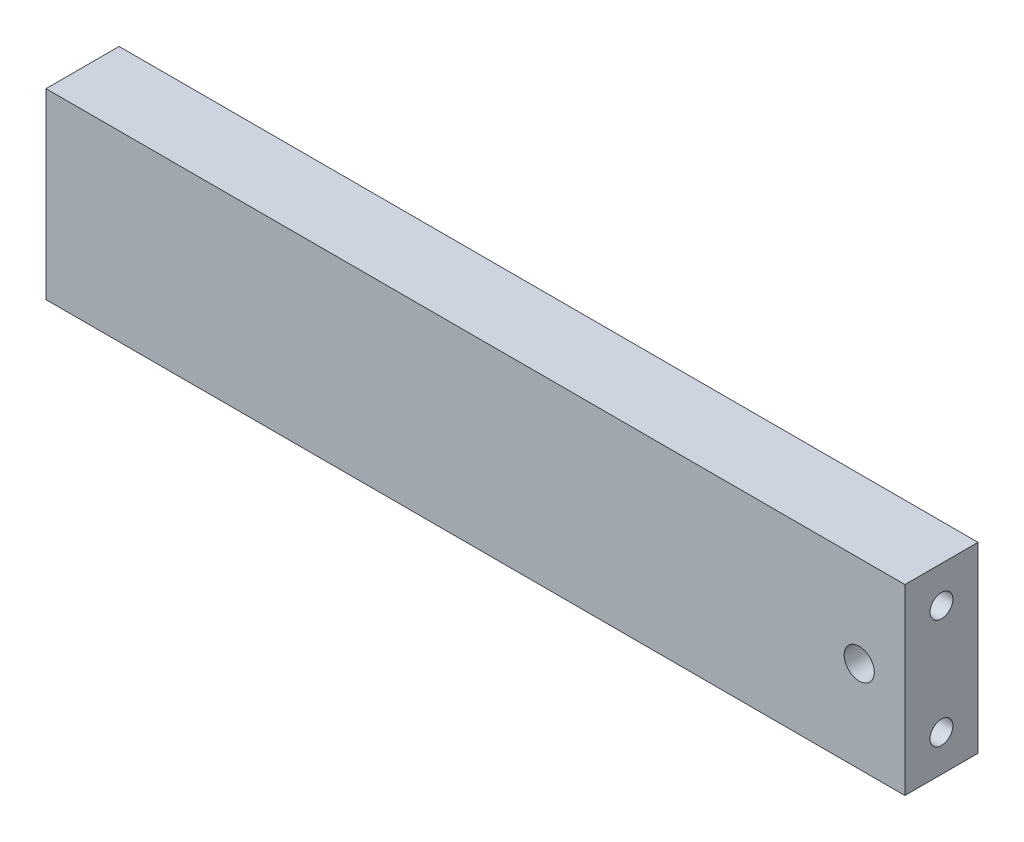
ISO-10303-21;
HEADER;
FILE_DESCRIPTION(('STEP AP214'),'2;1');
FILE_NAME('part.step','',(''),(''),'','','');
FILE_SCHEMA(('AUTOMOTIVE_DESIGN { 1 0 10303 214 1 1 1 1 }'));
ENDSEC;
DATA;
#1=APPLICATION_CONTEXT('core data for automotive mechanical design processes');
#2=APPLICATION_PROTOCOL_DEFINITION('international standard','automotive_design',2000,#1);
#3=PRODUCT_CONTEXT('',#1,'mechanical');
#4=PRODUCT('Part','Part','',(#3));
#5=PRODUCT_RELATED_PRODUCT_CATEGORY('part','',(#4));
#6=PRODUCT_DEFINITION_FORMATION('','',#4);
#7=PRODUCT_DEFINITION_CONTEXT('part definition',#1,'design');
#8=PRODUCT_DEFINITION('design','',#6,#7);
#9=PRODUCT_DEFINITION_SHAPE('','',#8);
#10=(LENGTH_UNIT() NAMED_UNIT(*) SI_UNIT(.MILLI.,.METRE.));
#11=(NAMED_UNIT(*) PLANE_ANGLE_UNIT() SI_UNIT($,.RADIAN.));
#12=(NAMED_UNIT(*) SI_UNIT($,.STERADIAN.) SOLID_ANGLE_UNIT());
#13=UNCERTAINTY_MEASURE_WITH_UNIT(LENGTH_MEASURE(1.E-05),#10,'distance_accuracy_value','');
#14=(GEOMETRIC_REPRESENTATION_CONTEXT(3) GLOBAL_UNCERTAINTY_ASSIGNED_CONTEXT((#13)) GLOBAL_UNIT_ASSIGNED_CONTEXT((#10,
#11,#12)) REPRESENTATION_CONTEXT('',''));
#15=CARTESIAN_POINT('',(0.,0.,0.));
#16=DIRECTION('',(0.,0.,1.));
#17=DIRECTION('',(1.,0.,0.));
#18=AXIS2_PLACEMENT_3D('',#15,#16,#17);
#19=CARTESIAN_POINT('',(47.,10.,8.));
#20=DIRECTION('',(-1.,0.,0.));
#21=DIRECTION('',(0.,0.,1.));
#22=AXIS2_PLACEMENT_3D('',#19,#20,#21);
#23=PLANE('',#22);
#24=CARTESIAN_POINT('',(47.,6.,4.));
#25=DIRECTION('',(1.,0.,0.));
#26=DIRECTION('',(0.,0.,-1.));
#27=AXIS2_PLACEMENT_3D('',#24,#25,#26);
#28=CIRCLE('',#27,1.24999999999999);
#29=CARTESIAN_POINT('',(47.,6.,2.75000000000001));
#30=VERTEX_POINT('',#29);
#31=EDGE_CURVE('E119',#30,#30,#28,.T.);
#32=ORIENTED_EDGE('',*,*,#31,.F.);
#33=EDGE_LOOP('',(#32));
#34=FACE_BOUND('',#33,.T.);
#35=CARTESIAN_POINT('',(47.,-6.,4.));
#36=DIRECTION('',(1.,0.,0.));
#37=DIRECTION('',(0.,0.,-1.));
#38=AXIS2_PLACEMENT_3D('',#35,#36,#37);
#39=CIRCLE('',#38,1.24999999999999);
#40=CARTESIAN_POINT('',(47.,-6.,2.75000000000001));
#41=VERTEX_POINT('',#40);
#42=EDGE_CURVE('E125',#41,#41,#39,.T.);
#43=ORIENTED_EDGE('',*,*,#42,.F.);
#44=EDGE_LOOP('',(#43));
#45=FACE_BOUND('',#44,.T.);
#46=DIRECTION('',(0.,1.,0.));
#47=VECTOR('',#46,1.);
#48=CARTESIAN_POINT('',(47.,10.,0.));
#49=LINE('',#48,#47);
#50=CARTESIAN_POINT('',(47.,-10.,0.));
#51=VERTEX_POINT('',#50);
#52=CARTESIAN_POINT('',(47.,10.,0.));
#53=VERTEX_POINT('',#52);
#54=EDGE_CURVE('E137',#51,#53,#49,.T.);
#55=ORIENTED_EDGE('',*,*,#54,.T.);
#56=DIRECTION('',(0.,0.,-1.));
#57=VECTOR('',#56,1.);
#58=CARTESIAN_POINT('',(47.,10.,8.));
#59=LINE('',#58,#57);
#60=CARTESIAN_POINT('',(47.,10.,8.));
#61=VERTEX_POINT('',#60);
#62=EDGE_CURVE('E11',#61,#53,#59,.T.);
#63=ORIENTED_EDGE('',*,*,#62,.F.);
#64=DIRECTION('',(0.,1.,0.));
#65=VECTOR('',#64,1.);
#66=CARTESIAN_POINT('',(47.,10.,8.));
#67=LINE('',#66,#65);
#68=CARTESIAN_POINT('',(47.,-10.,8.));
#69=VERTEX_POINT('',#68);
#70=EDGE_CURVE('E138',#69,#61,#67,.T.);
#71=ORIENTED_EDGE('',*,*,#70,.F.);
#72=DIRECTION('',(0.,0.,-1.));
#73=VECTOR('',#72,1.);
#74=CARTESIAN_POINT('',(47.,-10.,8.));
#75=LINE('',#74,#73);
#76=EDGE_CURVE('E144',#69,#51,#75,.T.);
#77=ORIENTED_EDGE('',*,*,#76,.T.);
#78=EDGE_LOOP('',(#55,#63,#71,#77));
#79=FACE_BOUND('',#78,.T.);
#80=ADVANCED_FACE('F38',(#34,#45,#79),#23,.F.);
#81=CARTESIAN_POINT('',(-47.,10.,8.));
#82=DIRECTION('',(0.,-1.,0.));
#83=DIRECTION('',(0.,0.,-1.));
#84=AXIS2_PLACEMENT_3D('',#81,#82,#83);
#85=PLANE('',#84);
#86=DIRECTION('',(-1.,0.,0.));
#87=VECTOR('',#86,1.);
#88=CARTESIAN_POINT('',(-47.,10.,0.));
#89=LINE('',#88,#87);
#90=CARTESIAN_POINT('',(-47.,10.,0.));
#91=VERTEX_POINT('',#90);
#92=EDGE_CURVE('E147',#53,#91,#89,.T.);
#93=ORIENTED_EDGE('',*,*,#92,.T.);
#94=DIRECTION('',(0.,0.,-1.));
#95=VECTOR('',#94,1.);
#96=CARTESIAN_POINT('',(-47.,10.,8.));
#97=LINE('',#96,#95);
#98=CARTESIAN_POINT('',(-47.,10.,8.));
#99=VERTEX_POINT('',#98);
#100=EDGE_CURVE('E46',#99,#91,#97,.T.);
#101=ORIENTED_EDGE('',*,*,#100,.F.);
#102=DIRECTION('',(-1.,0.,0.));
#103=VECTOR('',#102,1.);
#104=CARTESIAN_POINT('',(-47.,10.,8.));
#105=LINE('',#104,#103);
#106=EDGE_CURVE('E85',#61,#99,#105,.T.);
#107=ORIENTED_EDGE('',*,*,#106,.F.);
#108=ORIENTED_EDGE('',*,*,#62,.T.);
#109=EDGE_LOOP('',(#93,#101,#107,#108));
#110=FACE_BOUND('',#109,.T.);
#111=ADVANCED_FACE('F171',(#110),#85,.F.);
#112=CARTESIAN_POINT('',(-47.,10.,8.));
#113=DIRECTION('',(1.,0.,0.));
#114=DIRECTION('',(0.,1.,0.));
#115=AXIS2_PLACEMENT_3D('',#112,#113,#114);
#116=PLANE('',#115);
#117=CARTESIAN_POINT('',(-47.,5.99999999999999,4.));
#118=DIRECTION('',(-1.,0.,0.));
#119=DIRECTION('',(0.,0.,1.));
#120=AXIS2_PLACEMENT_3D('',#117,#118,#119);
#121=CIRCLE('',#120,1.24999999999999);
#122=CARTESIAN_POINT('',(-47.,5.99999999999999,5.24999999999999));
#123=VERTEX_POINT('',#122);
#124=EDGE_CURVE('E109',#123,#123,#121,.T.);
#125=ORIENTED_EDGE('',*,*,#124,.F.);
#126=EDGE_LOOP('',(#125));
#127=FACE_BOUND('',#126,.T.);
#128=CARTESIAN_POINT('',(-47.,-6.00000000000002,4.));
#129=DIRECTION('',(-1.,0.,0.));
#130=DIRECTION('',(0.,0.,1.));
#131=AXIS2_PLACEMENT_3D('',#128,#129,#130);
#132=CIRCLE('',#131,1.24999999999999);
#133=CARTESIAN_POINT('',(-47.,-6.00000000000002,5.24999999999999));
#134=VERTEX_POINT('',#133);
#135=EDGE_CURVE('E108',#134,#134,#132,.T.);
#136=ORIENTED_EDGE('',*,*,#135,.F.);
#137=EDGE_LOOP('',(#136));
#138=FACE_BOUND('',#137,.T.);
#139=DIRECTION('',(0.,-1.,0.));
#140=VECTOR('',#139,1.);
#141=CARTESIAN_POINT('',(-47.,10.,0.));
#142=LINE('',#141,#140);
#143=CARTESIAN_POINT('',(-47.,-10.,0.));
#144=VERTEX_POINT('',#143);
#145=EDGE_CURVE('E72',#91,#144,#142,.T.);
#146=ORIENTED_EDGE('',*,*,#145,.T.);
#147=DIRECTION('',(0.,0.,-1.));
#148=VECTOR('',#147,1.);
#149=CARTESIAN_POINT('',(-47.,-10.,8.));
#150=LINE('',#149,#148);
#151=CARTESIAN_POINT('',(-47.,-10.,8.));
#152=VERTEX_POINT('',#151);
#153=EDGE_CURVE('E152',#152,#144,#150,.T.);
#154=ORIENTED_EDGE('',*,*,#153,.F.);
#155=DIRECTION('',(0.,-1.,0.));
#156=VECTOR('',#155,1.);
#157=CARTESIAN_POINT('',(-47.,10.,8.));
#158=LINE('',#157,#156);
#159=EDGE_CURVE('E141',#99,#152,#158,.T.);
#160=ORIENTED_EDGE('',*,*,#159,.F.);
#161=ORIENTED_EDGE('',*,*,#100,.T.);
#162=EDGE_LOOP('',(#146,#154,#160,#161));
#163=FACE_BOUND('',#162,.T.);
#164=ADVANCED_FACE('F154',(#127,#138,#163),#116,.F.);
#165=CARTESIAN_POINT('',(-47.,-10.,8.));
#166=DIRECTION('',(0.,1.,0.));
#167=DIRECTION('',(0.,0.,1.));
#168=AXIS2_PLACEMENT_3D('',#165,#166,#167);
#169=PLANE('',#168);
#170=DIRECTION('',(1.,0.,0.));
#171=VECTOR('',#170,1.);
#172=CARTESIAN_POINT('',(-47.,-10.,0.));
#173=LINE('',#172,#171);
#174=EDGE_CURVE('E78',#144,#51,#173,.T.);
#175=ORIENTED_EDGE('',*,*,#174,.T.);
#176=ORIENTED_EDGE('',*,*,#76,.F.);
#177=DIRECTION('',(1.,0.,0.));
#178=VECTOR('',#177,1.);
#179=CARTESIAN_POINT('',(-47.,-10.,8.));
#180=LINE('',#179,#178);
#181=EDGE_CURVE('E54',#152,#69,#180,.T.);
#182=ORIENTED_EDGE('',*,*,#181,.F.);
#183=ORIENTED_EDGE('',*,*,#153,.T.);
#184=EDGE_LOOP('',(#175,#176,#182,#183));
#185=FACE_BOUND('',#184,.T.);
#186=ADVANCED_FACE('F161',(#185),#169,.F.);
#187=CARTESIAN_POINT('',(0.,0.,8.));
#188=DIRECTION('',(0.,0.,1.));
#189=DIRECTION('',(1.,0.,0.));
#190=AXIS2_PLACEMENT_3D('',#187,#188,#189);
#191=PLANE('',#190);
#192=CARTESIAN_POINT('',(42.,0.,8.));
#193=DIRECTION('',(0.,0.,1.));
#194=DIRECTION('',(1.,0.,0.));
#195=AXIS2_PLACEMENT_3D('',#192,#193,#194);
#196=CIRCLE('',#195,1.65);
#197=CARTESIAN_POINT('',(43.65,0.,8.));
#198=VERTEX_POINT('',#197);
#199=EDGE_CURVE('E131',#198,#198,#196,.T.);
#200=ORIENTED_EDGE('',*,*,#199,.F.);
#201=EDGE_LOOP('',(#200));
#202=FACE_BOUND('',#201,.T.);
#203=ORIENTED_EDGE('',*,*,#70,.T.);
#204=ORIENTED_EDGE('',*,*,#106,.T.);
#205=ORIENTED_EDGE('',*,*,#159,.T.);
#206=ORIENTED_EDGE('',*,*,#181,.T.);
#207=EDGE_LOOP('',(#203,#204,#205,#206));
#208=FACE_BOUND('',#207,.T.);
#209=ADVANCED_FACE('F163',(#202,#208),#191,.T.);
#210=CARTESIAN_POINT('',(0.,0.,0.));
#211=DIRECTION('',(0.,0.,1.));
#212=DIRECTION('',(1.,0.,0.));
#213=AXIS2_PLACEMENT_3D('',#210,#211,#212);
#214=PLANE('',#213);
#215=CARTESIAN_POINT('',(42.,0.,0.));
#216=DIRECTION('',(0.,0.,1.));
#217=DIRECTION('',(1.,0.,0.));
#218=AXIS2_PLACEMENT_3D('',#215,#216,#217);
#219=CIRCLE('',#218,1.65);
#220=CARTESIAN_POINT('',(43.65,0.,0.));
#221=VERTEX_POINT('',#220);
#222=EDGE_CURVE('E134',#221,#221,#219,.T.);
#223=ORIENTED_EDGE('',*,*,#222,.T.);
#224=EDGE_LOOP('',(#223));
#225=FACE_BOUND('',#224,.T.);
#226=ORIENTED_EDGE('',*,*,#54,.F.);
#227=ORIENTED_EDGE('',*,*,#174,.F.);
#228=ORIENTED_EDGE('',*,*,#145,.F.);
#229=ORIENTED_EDGE('',*,*,#92,.F.);
#230=EDGE_LOOP('',(#226,#227,#228,#229));
#231=FACE_BOUND('',#230,.T.);
#232=ADVANCED_FACE('F157',(#225,#231),#214,.F.);
#233=CARTESIAN_POINT('',(42.,0.,8.));
#234=DIRECTION('',(0.,0.,1.));
#235=DIRECTION('',(1.,0.,0.));
#236=AXIS2_PLACEMENT_3D('',#233,#234,#235);
#237=CYLINDRICAL_SURFACE('',#236,1.65);
#238=ORIENTED_EDGE('',*,*,#222,.F.);
#239=EDGE_LOOP('',(#238));
#240=FACE_BOUND('',#239,.T.);
#241=ORIENTED_EDGE('',*,*,#199,.T.);
#242=EDGE_LOOP('',(#241));
#243=FACE_BOUND('',#242,.T.);
#244=ADVANCED_FACE('F197',(#240,#243),#237,.F.);
#245=CARTESIAN_POINT('',(38.5,-6.,4.));
#246=DIRECTION('',(1.,0.,0.));
#247=DIRECTION('',(0.,0.,-1.));
#248=AXIS2_PLACEMENT_3D('',#245,#246,#247);
#249=CONICAL_SURFACE('',#248,1.25,1.02974425867665);
#250=CARTESIAN_POINT('',(37.7489242262156,-6.,4.));
#251=VERTEX_POINT('',#250);
#252=VERTEX_LOOP('',#251);
#253=FACE_BOUND('',#252,.T.);
#254=CARTESIAN_POINT('',(38.5,-6.,4.));
#255=DIRECTION('',(1.,0.,0.));
#256=DIRECTION('',(0.,0.,-1.));
#257=AXIS2_PLACEMENT_3D('',#254,#255,#256);
#258=CIRCLE('',#257,1.25);
#259=CARTESIAN_POINT('',(38.5,-6.,2.75));
#260=VERTEX_POINT('',#259);
#261=EDGE_CURVE('E128',#260,#260,#258,.T.);
#262=ORIENTED_EDGE('',*,*,#261,.T.);
#263=EDGE_LOOP('',(#262));
#264=FACE_BOUND('',#263,.T.);
#265=ADVANCED_FACE('F187',(#253,#264),#249,.F.);
#266=CARTESIAN_POINT('',(47.,-6.,4.));
#267=DIRECTION('',(1.,0.,0.));
#268=DIRECTION('',(0.,0.,-1.));
#269=AXIS2_PLACEMENT_3D('',#266,#267,#268);
#270=CYLINDRICAL_SURFACE('',#269,1.24999999999999);
#271=ORIENTED_EDGE('',*,*,#261,.F.);
#272=EDGE_LOOP('',(#271));
#273=FACE_BOUND('',#272,.T.);
#274=ORIENTED_EDGE('',*,*,#42,.T.);
#275=EDGE_LOOP('',(#274));
#276=FACE_BOUND('',#275,.T.);
#277=ADVANCED_FACE('F184',(#273,#276),#270,.F.);
#278=CARTESIAN_POINT('',(38.5,6.,4.));
#279=DIRECTION('',(1.,0.,0.));
#280=DIRECTION('',(0.,0.,-1.));
#281=AXIS2_PLACEMENT_3D('',#278,#279,#280);
#282=CONICAL_SURFACE('',#281,1.25,1.02974425867665);
#283=CARTESIAN_POINT('',(37.7489242262156,6.,4.));
#284=VERTEX_POINT('',#283);
#285=VERTEX_LOOP('',#284);
#286=FACE_BOUND('',#285,.T.);
#287=CARTESIAN_POINT('',(38.5,6.,4.));
#288=DIRECTION('',(1.,0.,0.));
#289=DIRECTION('',(0.,0.,-1.));
#290=AXIS2_PLACEMENT_3D('',#287,#288,#289);
#291=CIRCLE('',#290,1.25);
#292=CARTESIAN_POINT('',(38.5,6.,2.75));
#293=VERTEX_POINT('',#292);
#294=EDGE_CURVE('E122',#293,#293,#291,.T.);
#295=ORIENTED_EDGE('',*,*,#294,.T.);
#296=EDGE_LOOP('',(#295));
#297=FACE_BOUND('',#296,.T.);
#298=ADVANCED_FACE('F186',(#286,#297),#282,.F.);
#299=CARTESIAN_POINT('',(47.,6.,4.));
#300=DIRECTION('',(1.,0.,0.));
#301=DIRECTION('',(0.,0.,-1.));
#302=AXIS2_PLACEMENT_3D('',#299,#300,#301);
#303=CYLINDRICAL_SURFACE('',#302,1.24999999999999);
#304=ORIENTED_EDGE('',*,*,#294,.F.);
#305=EDGE_LOOP('',(#304));
#306=FACE_BOUND('',#305,.T.);
#307=ORIENTED_EDGE('',*,*,#31,.T.);
#308=EDGE_LOOP('',(#307));
#309=FACE_BOUND('',#308,.T.);
#310=ADVANCED_FACE('F194',(#306,#309),#303,.F.);
#311=CARTESIAN_POINT('',(-38.5,-6.00000000000002,4.));
#312=DIRECTION('',(-1.,0.,0.));
#313=DIRECTION('',(0.,0.,1.));
#314=AXIS2_PLACEMENT_3D('',#311,#312,#313);
#315=CONICAL_SURFACE('',#314,1.25,1.02974425867665);
#316=CARTESIAN_POINT('',(-37.7489242262156,-6.00000000000002,4.));
#317=VERTEX_POINT('',#316);
#318=VERTEX_LOOP('',#317);
#319=FACE_BOUND('',#318,.T.);
#320=CARTESIAN_POINT('',(-38.5,-6.00000000000002,4.));
#321=DIRECTION('',(-1.,0.,0.));
#322=DIRECTION('',(0.,0.,1.));
#323=AXIS2_PLACEMENT_3D('',#320,#321,#322);
#324=CIRCLE('',#323,1.25);
#325=CARTESIAN_POINT('',(-38.5,-6.00000000000002,5.25));
#326=VERTEX_POINT('',#325);
#327=EDGE_CURVE('E112',#326,#326,#324,.T.);
#328=ORIENTED_EDGE('',*,*,#327,.T.);
#329=EDGE_LOOP('',(#328));
#330=FACE_BOUND('',#329,.T.);
#331=ADVANCED_FACE('F254',(#319,#330),#315,.F.);
#332=CARTESIAN_POINT('',(-47.,-6.00000000000002,4.));
#333=DIRECTION('',(-1.,0.,0.));
#334=DIRECTION('',(0.,0.,1.));
#335=AXIS2_PLACEMENT_3D('',#332,#333,#334);
#336=CYLINDRICAL_SURFACE('',#335,1.24999999999999);
#337=ORIENTED_EDGE('',*,*,#327,.F.);
#338=EDGE_LOOP('',(#337));
#339=FACE_BOUND('',#338,.T.);
#340=ORIENTED_EDGE('',*,*,#135,.T.);
#341=EDGE_LOOP('',(#340));
#342=FACE_BOUND('',#341,.T.);
#343=ADVANCED_FACE('F102',(#339,#342),#336,.F.);
#344=CARTESIAN_POINT('',(-38.5,5.99999999999999,4.));
#345=DIRECTION('',(-1.,0.,0.));
#346=DIRECTION('',(0.,0.,1.));
#347=AXIS2_PLACEMENT_3D('',#344,#345,#346);
#348=CONICAL_SURFACE('',#347,1.25,1.02974425867665);
#349=CARTESIAN_POINT('',(-37.7489242262156,5.99999999999998,4.));
#350=VERTEX_POINT('',#349);
#351=VERTEX_LOOP('',#350);
#352=FACE_BOUND('',#351,.T.);
#353=CARTESIAN_POINT('',(-38.5,5.99999999999999,4.));
#354=DIRECTION('',(-1.,0.,0.));
#355=DIRECTION('',(0.,0.,1.));
#356=AXIS2_PLACEMENT_3D('',#353,#354,#355);
#357=CIRCLE('',#356,1.25);
#358=CARTESIAN_POINT('',(-38.5,5.99999999999999,5.25));
#359=VERTEX_POINT('',#358);
#360=EDGE_CURVE('E106',#359,#359,#357,.T.);
#361=ORIENTED_EDGE('',*,*,#360,.T.);
#362=EDGE_LOOP('',(#361));
#363=FACE_BOUND('',#362,.T.);
#364=ADVANCED_FACE('F98',(#352,#363),#348,.F.);
#365=CARTESIAN_POINT('',(-47.,5.99999999999999,4.));
#366=DIRECTION('',(-1.,0.,0.));
#367=DIRECTION('',(0.,0.,1.));
#368=AXIS2_PLACEMENT_3D('',#365,#366,#367);
#369=CYLINDRICAL_SURFACE('',#368,1.24999999999999);
#370=ORIENTED_EDGE('',*,*,#360,.F.);
#371=EDGE_LOOP('',(#370));
#372=FACE_BOUND('',#371,.T.);
#373=ORIENTED_EDGE('',*,*,#124,.T.);
#374=EDGE_LOOP('',(#373));
#375=FACE_BOUND('',#374,.T.);
#376=ADVANCED_FACE('F101',(#372,#375),#369,.F.);
#377=CLOSED_SHELL('',(#80,#111,#164,#186,#209,#232,#244,#265,#277,#298,#310,#331,#343,#364,#376));
#378=MANIFOLD_SOLID_BREP('B2',#377);
#379=ADVANCED_BREP_SHAPE_REPRESENTATION('',(#18,#378),#14);
#380=SHAPE_DEFINITION_REPRESENTATION(#9,#379);
ENDSEC;
END-ISO-10303-21;
